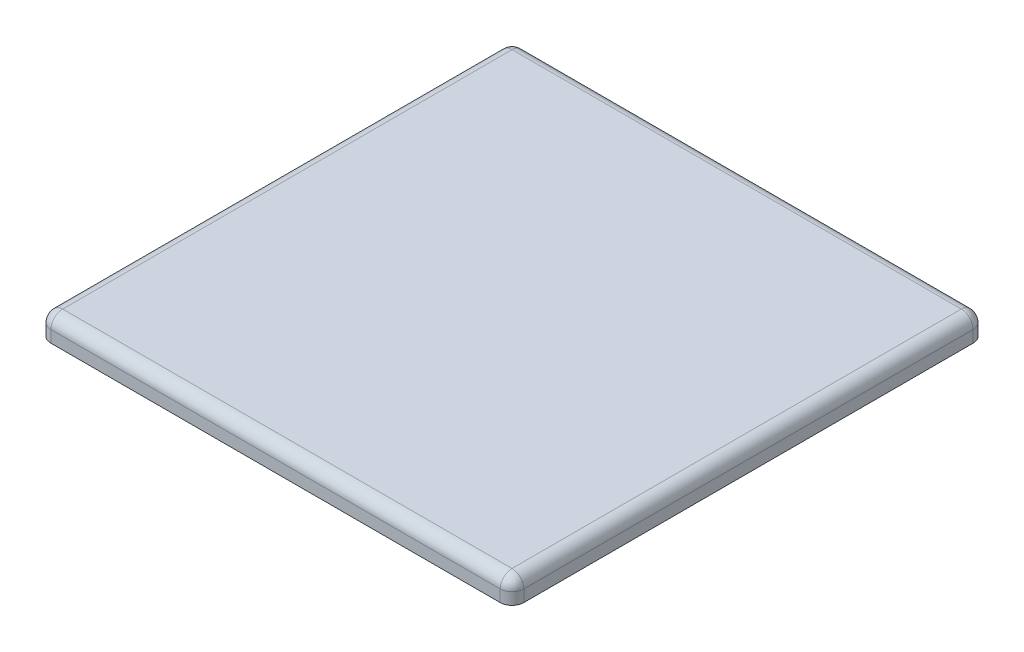
ISO-10303-21;
HEADER;
FILE_DESCRIPTION(('STEP AP214'),'2;1');
FILE_NAME('part.step','',(''),(''),'','','');
FILE_SCHEMA(('AUTOMOTIVE_DESIGN { 1 0 10303 214 1 1 1 1 }'));
ENDSEC;
DATA;
#1=APPLICATION_CONTEXT('core data for automotive mechanical design processes');
#2=APPLICATION_PROTOCOL_DEFINITION('international standard','automotive_design',2000,#1);
#3=PRODUCT_CONTEXT('',#1,'mechanical');
#4=PRODUCT('Part','Part','',(#3));
#5=PRODUCT_RELATED_PRODUCT_CATEGORY('part','',(#4));
#6=PRODUCT_DEFINITION_FORMATION('','',#4);
#7=PRODUCT_DEFINITION_CONTEXT('part definition',#1,'design');
#8=PRODUCT_DEFINITION('design','',#6,#7);
#9=PRODUCT_DEFINITION_SHAPE('','',#8);
#10=(LENGTH_UNIT() NAMED_UNIT(*) SI_UNIT(.MILLI.,.METRE.));
#11=(NAMED_UNIT(*) PLANE_ANGLE_UNIT() SI_UNIT($,.RADIAN.));
#12=(NAMED_UNIT(*) SI_UNIT($,.STERADIAN.) SOLID_ANGLE_UNIT());
#13=UNCERTAINTY_MEASURE_WITH_UNIT(LENGTH_MEASURE(1.E-05),#10,'distance_accuracy_value','');
#14=(GEOMETRIC_REPRESENTATION_CONTEXT(3) GLOBAL_UNCERTAINTY_ASSIGNED_CONTEXT((#13)) GLOBAL_UNIT_ASSIGNED_CONTEXT((#10,
#11,#12)) REPRESENTATION_CONTEXT('',''));
#15=CARTESIAN_POINT('',(0.,0.,0.));
#16=DIRECTION('',(0.,0.,1.));
#17=DIRECTION('',(1.,0.,0.));
#18=AXIS2_PLACEMENT_3D('',#15,#16,#17);
#19=CARTESIAN_POINT('',(254.,25.4,-254.));
#20=DIRECTION('',(-1.,0.,0.));
#21=DIRECTION('',(0.,0.,1.));
#22=AXIS2_PLACEMENT_3D('',#19,#20,#21);
#23=PLANE('',#22);
#24=DIRECTION('',(0.,0.,-1.));
#25=VECTOR('',#24,1.);
#26=CARTESIAN_POINT('',(254.,0.,-254.));
#27=LINE('',#26,#25);
#28=CARTESIAN_POINT('',(254.,0.,241.3));
#29=VERTEX_POINT('',#28);
#30=CARTESIAN_POINT('',(254.,0.,-241.3));
#31=VERTEX_POINT('',#30);
#32=EDGE_CURVE('E166',#29,#31,#27,.T.);
#33=ORIENTED_EDGE('',*,*,#32,.T.);
#34=DIRECTION('',(0.,-1.,0.));
#35=VECTOR('',#34,1.);
#36=CARTESIAN_POINT('',(254.,25.4,-241.3));
#37=LINE('',#36,#35);
#38=CARTESIAN_POINT('',(254.,12.7,-241.3));
#39=VERTEX_POINT('',#38);
#40=EDGE_CURVE('E156',#31,#39,#37,.F.);
#41=ORIENTED_EDGE('',*,*,#40,.T.);
#42=DIRECTION('',(0.,0.,-1.));
#43=VECTOR('',#42,1.);
#44=CARTESIAN_POINT('',(254.,12.7,254.));
#45=LINE('',#44,#43);
#46=CARTESIAN_POINT('',(254.,12.7,241.3));
#47=VERTEX_POINT('',#46);
#48=EDGE_CURVE('E202',#39,#47,#45,.F.);
#49=ORIENTED_EDGE('',*,*,#48,.T.);
#50=DIRECTION('',(0.,-1.,0.));
#51=VECTOR('',#50,1.);
#52=CARTESIAN_POINT('',(254.,25.4,241.3));
#53=LINE('',#52,#51);
#54=EDGE_CURVE('E148',#47,#29,#53,.T.);
#55=ORIENTED_EDGE('',*,*,#54,.T.);
#56=EDGE_LOOP('',(#33,#41,#49,#55));
#57=FACE_BOUND('',#56,.T.);
#58=ADVANCED_FACE('F38',(#57),#23,.F.);
#59=CARTESIAN_POINT('',(-254.,25.4,-254.));
#60=DIRECTION('',(0.,0.,1.));
#61=DIRECTION('',(1.,0.,0.));
#62=AXIS2_PLACEMENT_3D('',#59,#60,#61);
#63=PLANE('',#62);
#64=DIRECTION('',(-1.,0.,0.));
#65=VECTOR('',#64,1.);
#66=CARTESIAN_POINT('',(-254.,0.,-254.));
#67=LINE('',#66,#65);
#68=CARTESIAN_POINT('',(241.3,0.,-254.));
#69=VERTEX_POINT('',#68);
#70=CARTESIAN_POINT('',(-241.3,0.,-254.));
#71=VERTEX_POINT('',#70);
#72=EDGE_CURVE('E218',#69,#71,#67,.T.);
#73=ORIENTED_EDGE('',*,*,#72,.T.);
#74=DIRECTION('',(0.,-1.,0.));
#75=VECTOR('',#74,1.);
#76=CARTESIAN_POINT('',(-241.3,25.4,-254.));
#77=LINE('',#76,#75);
#78=CARTESIAN_POINT('',(-241.3,12.7,-254.));
#79=VERTEX_POINT('',#78);
#80=EDGE_CURVE('E186',#71,#79,#77,.F.);
#81=ORIENTED_EDGE('',*,*,#80,.T.);
#82=DIRECTION('',(-1.,0.,0.));
#83=VECTOR('',#82,1.);
#84=CARTESIAN_POINT('',(254.,12.7,-254.));
#85=LINE('',#84,#83);
#86=CARTESIAN_POINT('',(241.3,12.7,-254.));
#87=VERTEX_POINT('',#86);
#88=EDGE_CURVE('E208',#79,#87,#85,.F.);
#89=ORIENTED_EDGE('',*,*,#88,.T.);
#90=DIRECTION('',(0.,-1.,0.));
#91=VECTOR('',#90,1.);
#92=CARTESIAN_POINT('',(241.3,25.4,-254.));
#93=LINE('',#92,#91);
#94=EDGE_CURVE('E188',#87,#69,#93,.T.);
#95=ORIENTED_EDGE('',*,*,#94,.T.);
#96=EDGE_LOOP('',(#73,#81,#89,#95));
#97=FACE_BOUND('',#96,.T.);
#98=ADVANCED_FACE('F239',(#97),#63,.F.);
#99=CARTESIAN_POINT('',(-254.,25.4,-254.));
#100=DIRECTION('',(1.,0.,0.));
#101=DIRECTION('',(0.,0.,-1.));
#102=AXIS2_PLACEMENT_3D('',#99,#100,#101);
#103=PLANE('',#102);
#104=DIRECTION('',(0.,0.,1.));
#105=VECTOR('',#104,1.);
#106=CARTESIAN_POINT('',(-254.,12.7,-254.));
#107=LINE('',#106,#105);
#108=CARTESIAN_POINT('',(-254.,12.7,241.3));
#109=VERTEX_POINT('',#108);
#110=CARTESIAN_POINT('',(-254.,12.7,-241.3));
#111=VERTEX_POINT('',#110);
#112=EDGE_CURVE('E205',#109,#111,#107,.F.);
#113=ORIENTED_EDGE('',*,*,#112,.T.);
#114=DIRECTION('',(0.,-1.,0.));
#115=VECTOR('',#114,1.);
#116=CARTESIAN_POINT('',(-254.,25.4,-241.3));
#117=LINE('',#116,#115);
#118=CARTESIAN_POINT('',(-254.,0.,-241.3));
#119=VERTEX_POINT('',#118);
#120=EDGE_CURVE('E198',#111,#119,#117,.T.);
#121=ORIENTED_EDGE('',*,*,#120,.T.);
#122=DIRECTION('',(0.,0.,1.));
#123=VECTOR('',#122,1.);
#124=CARTESIAN_POINT('',(-254.,0.,-254.));
#125=LINE('',#124,#123);
#126=CARTESIAN_POINT('',(-254.,0.,241.3));
#127=VERTEX_POINT('',#126);
#128=EDGE_CURVE('E215',#119,#127,#125,.T.);
#129=ORIENTED_EDGE('',*,*,#128,.T.);
#130=DIRECTION('',(0.,-1.,0.));
#131=VECTOR('',#130,1.);
#132=CARTESIAN_POINT('',(-254.,25.4,241.3));
#133=LINE('',#132,#131);
#134=EDGE_CURVE('E175',#127,#109,#133,.F.);
#135=ORIENTED_EDGE('',*,*,#134,.T.);
#136=EDGE_LOOP('',(#113,#121,#129,#135));
#137=FACE_BOUND('',#136,.T.);
#138=ADVANCED_FACE('F251',(#137),#103,.F.);
#139=CARTESIAN_POINT('',(-254.,25.4,254.));
#140=DIRECTION('',(0.,0.,-1.));
#141=DIRECTION('',(-1.,0.,0.));
#142=AXIS2_PLACEMENT_3D('',#139,#140,#141);
#143=PLANE('',#142);
#144=DIRECTION('',(1.,0.,0.));
#145=VECTOR('',#144,1.);
#146=CARTESIAN_POINT('',(-254.,0.,254.));
#147=LINE('',#146,#145);
#148=CARTESIAN_POINT('',(-241.3,0.,254.));
#149=VERTEX_POINT('',#148);
#150=CARTESIAN_POINT('',(241.3,0.,254.));
#151=VERTEX_POINT('',#150);
#152=EDGE_CURVE('E141',#149,#151,#147,.T.);
#153=ORIENTED_EDGE('',*,*,#152,.T.);
#154=DIRECTION('',(0.,-1.,0.));
#155=VECTOR('',#154,1.);
#156=CARTESIAN_POINT('',(241.3,25.4,254.));
#157=LINE('',#156,#155);
#158=CARTESIAN_POINT('',(241.3,12.7,254.));
#159=VERTEX_POINT('',#158);
#160=EDGE_CURVE('E61',#151,#159,#157,.F.);
#161=ORIENTED_EDGE('',*,*,#160,.T.);
#162=DIRECTION('',(1.,0.,0.));
#163=VECTOR('',#162,1.);
#164=CARTESIAN_POINT('',(-254.,12.7,254.));
#165=LINE('',#164,#163);
#166=CARTESIAN_POINT('',(-241.3,12.7,254.));
#167=VERTEX_POINT('',#166);
#168=EDGE_CURVE('E118',#159,#167,#165,.F.);
#169=ORIENTED_EDGE('',*,*,#168,.T.);
#170=DIRECTION('',(0.,-1.,0.));
#171=VECTOR('',#170,1.);
#172=CARTESIAN_POINT('',(-241.3,25.4,254.));
#173=LINE('',#172,#171);
#174=EDGE_CURVE('E158',#167,#149,#173,.T.);
#175=ORIENTED_EDGE('',*,*,#174,.T.);
#176=EDGE_LOOP('',(#153,#161,#169,#175));
#177=FACE_BOUND('',#176,.T.);
#178=ADVANCED_FACE('F255',(#177),#143,.F.);
#179=CARTESIAN_POINT('',(0.,25.4,0.));
#180=DIRECTION('',(0.,1.,0.));
#181=DIRECTION('',(0.,0.,1.));
#182=AXIS2_PLACEMENT_3D('',#179,#180,#181);
#183=PLANE('',#182);
#184=DIRECTION('',(0.,0.,-1.));
#185=VECTOR('',#184,1.);
#186=CARTESIAN_POINT('',(241.3,25.4,-254.));
#187=LINE('',#186,#185);
#188=CARTESIAN_POINT('',(241.3,25.4,241.3));
#189=VERTEX_POINT('',#188);
#190=CARTESIAN_POINT('',(241.3,25.4,-241.3));
#191=VERTEX_POINT('',#190);
#192=EDGE_CURVE('E129',#189,#191,#187,.T.);
#193=ORIENTED_EDGE('',*,*,#192,.T.);
#194=DIRECTION('',(-1.,0.,0.));
#195=VECTOR('',#194,1.);
#196=CARTESIAN_POINT('',(-254.,25.4,-241.3));
#197=LINE('',#196,#195);
#198=CARTESIAN_POINT('',(-241.3,25.4,-241.3));
#199=VERTEX_POINT('',#198);
#200=EDGE_CURVE('E211',#191,#199,#197,.T.);
#201=ORIENTED_EDGE('',*,*,#200,.T.);
#202=DIRECTION('',(0.,0.,1.));
#203=VECTOR('',#202,1.);
#204=CARTESIAN_POINT('',(-241.3,25.4,254.));
#205=LINE('',#204,#203);
#206=CARTESIAN_POINT('',(-241.3,25.4,241.3));
#207=VERTEX_POINT('',#206);
#208=EDGE_CURVE('E132',#199,#207,#205,.T.);
#209=ORIENTED_EDGE('',*,*,#208,.T.);
#210=DIRECTION('',(1.,0.,0.));
#211=VECTOR('',#210,1.);
#212=CARTESIAN_POINT('',(254.,25.4,241.3));
#213=LINE('',#212,#211);
#214=EDGE_CURVE('E117',#207,#189,#213,.T.);
#215=ORIENTED_EDGE('',*,*,#214,.T.);
#216=EDGE_LOOP('',(#193,#201,#209,#215));
#217=FACE_BOUND('',#216,.T.);
#218=ADVANCED_FACE('F127',(#217),#183,.T.);
#219=CARTESIAN_POINT('',(0.,0.,0.));
#220=DIRECTION('',(0.,1.,0.));
#221=DIRECTION('',(0.,0.,1.));
#222=AXIS2_PLACEMENT_3D('',#219,#220,#221);
#223=PLANE('',#222);
#224=ORIENTED_EDGE('',*,*,#128,.F.);
#225=CARTESIAN_POINT('',(-241.3,0.,-241.3));
#226=DIRECTION('',(0.,1.,0.));
#227=DIRECTION('',(0.,0.,1.));
#228=AXIS2_PLACEMENT_3D('',#225,#226,#227);
#229=CIRCLE('',#228,12.7);
#230=EDGE_CURVE('E190',#119,#71,#229,.F.);
#231=ORIENTED_EDGE('',*,*,#230,.T.);
#232=ORIENTED_EDGE('',*,*,#72,.F.);
#233=CARTESIAN_POINT('',(241.3,0.,-241.3));
#234=DIRECTION('',(0.,1.,0.));
#235=DIRECTION('',(0.,0.,1.));
#236=AXIS2_PLACEMENT_3D('',#233,#234,#235);
#237=CIRCLE('',#236,12.7);
#238=EDGE_CURVE('E192',#69,#31,#237,.F.);
#239=ORIENTED_EDGE('',*,*,#238,.T.);
#240=ORIENTED_EDGE('',*,*,#32,.F.);
#241=CARTESIAN_POINT('',(241.3,0.,241.3));
#242=DIRECTION('',(0.,1.,0.));
#243=DIRECTION('',(0.,0.,1.));
#244=AXIS2_PLACEMENT_3D('',#241,#242,#243);
#245=CIRCLE('',#244,12.7);
#246=EDGE_CURVE('E194',#29,#151,#245,.F.);
#247=ORIENTED_EDGE('',*,*,#246,.T.);
#248=ORIENTED_EDGE('',*,*,#152,.F.);
#249=CARTESIAN_POINT('',(-241.3,0.,241.3));
#250=DIRECTION('',(0.,1.,0.));
#251=DIRECTION('',(0.,0.,1.));
#252=AXIS2_PLACEMENT_3D('',#249,#250,#251);
#253=CIRCLE('',#252,12.7);
#254=EDGE_CURVE('E196',#149,#127,#253,.F.);
#255=ORIENTED_EDGE('',*,*,#254,.T.);
#256=EDGE_LOOP('',(#224,#231,#232,#239,#240,#247,#248,#255));
#257=FACE_BOUND('',#256,.T.);
#258=ADVANCED_FACE('F253',(#257),#223,.F.);
#259=CARTESIAN_POINT('',(0.,12.7,241.3));
#260=DIRECTION('',(-1.,0.,0.));
#261=DIRECTION('',(0.,0.,1.));
#262=AXIS2_PLACEMENT_3D('',#259,#260,#261);
#263=CYLINDRICAL_SURFACE('',#262,12.7);
#264=ORIENTED_EDGE('',*,*,#168,.F.);
#265=CARTESIAN_POINT('',(241.3,12.7,241.3));
#266=DIRECTION('',(-1.,0.,0.));
#267=DIRECTION('',(0.,0.,1.));
#268=AXIS2_PLACEMENT_3D('',#265,#266,#267);
#269=CIRCLE('',#268,12.7);
#270=EDGE_CURVE('E11',#159,#189,#269,.T.);
#271=ORIENTED_EDGE('',*,*,#270,.T.);
#272=ORIENTED_EDGE('',*,*,#214,.F.);
#273=CARTESIAN_POINT('',(-241.3,12.7,241.3));
#274=DIRECTION('',(-1.,0.,0.));
#275=DIRECTION('',(0.,0.,1.));
#276=AXIS2_PLACEMENT_3D('',#273,#274,#275);
#277=CIRCLE('',#276,12.7);
#278=EDGE_CURVE('E47',#207,#167,#277,.F.);
#279=ORIENTED_EDGE('',*,*,#278,.T.);
#280=EDGE_LOOP('',(#264,#271,#272,#279));
#281=FACE_BOUND('',#280,.T.);
#282=ADVANCED_FACE('F116',(#281),#263,.T.);
#283=CARTESIAN_POINT('',(241.3,12.7,0.));
#284=DIRECTION('',(0.,0.,1.));
#285=DIRECTION('',(1.,0.,0.));
#286=AXIS2_PLACEMENT_3D('',#283,#284,#285);
#287=CYLINDRICAL_SURFACE('',#286,12.7);
#288=ORIENTED_EDGE('',*,*,#48,.F.);
#289=CARTESIAN_POINT('',(241.3,12.7,-241.3));
#290=DIRECTION('',(0.,0.,1.));
#291=DIRECTION('',(1.,0.,0.));
#292=AXIS2_PLACEMENT_3D('',#289,#290,#291);
#293=CIRCLE('',#292,12.7);
#294=EDGE_CURVE('E140',#39,#191,#293,.T.);
#295=ORIENTED_EDGE('',*,*,#294,.T.);
#296=ORIENTED_EDGE('',*,*,#192,.F.);
#297=CARTESIAN_POINT('',(241.3,12.7,241.3));
#298=DIRECTION('',(0.,0.,1.));
#299=DIRECTION('',(1.,0.,0.));
#300=AXIS2_PLACEMENT_3D('',#297,#298,#299);
#301=CIRCLE('',#300,12.7);
#302=EDGE_CURVE('E137',#189,#47,#301,.F.);
#303=ORIENTED_EDGE('',*,*,#302,.T.);
#304=EDGE_LOOP('',(#288,#295,#296,#303));
#305=FACE_BOUND('',#304,.T.);
#306=ADVANCED_FACE('F136',(#305),#287,.T.);
#307=CARTESIAN_POINT('',(-241.3,12.7,0.));
#308=DIRECTION('',(0.,0.,-1.));
#309=DIRECTION('',(-1.,0.,0.));
#310=AXIS2_PLACEMENT_3D('',#307,#308,#309);
#311=CYLINDRICAL_SURFACE('',#310,12.7);
#312=ORIENTED_EDGE('',*,*,#208,.F.);
#313=CARTESIAN_POINT('',(-241.3,12.7,-241.3));
#314=DIRECTION('',(0.,0.,-1.));
#315=DIRECTION('',(-1.,0.,0.));
#316=AXIS2_PLACEMENT_3D('',#313,#314,#315);
#317=CIRCLE('',#316,12.7);
#318=EDGE_CURVE('E146',#199,#111,#317,.F.);
#319=ORIENTED_EDGE('',*,*,#318,.T.);
#320=ORIENTED_EDGE('',*,*,#112,.F.);
#321=CARTESIAN_POINT('',(-241.3,12.7,241.3));
#322=DIRECTION('',(0.,0.,-1.));
#323=DIRECTION('',(-1.,0.,0.));
#324=AXIS2_PLACEMENT_3D('',#321,#322,#323);
#325=CIRCLE('',#324,12.7);
#326=EDGE_CURVE('E150',#109,#207,#325,.T.);
#327=ORIENTED_EDGE('',*,*,#326,.T.);
#328=EDGE_LOOP('',(#312,#319,#320,#327));
#329=FACE_BOUND('',#328,.T.);
#330=ADVANCED_FACE('F249',(#329),#311,.T.);
#331=CARTESIAN_POINT('',(0.,12.7,-241.3));
#332=DIRECTION('',(1.,0.,0.));
#333=DIRECTION('',(0.,0.,-1.));
#334=AXIS2_PLACEMENT_3D('',#331,#332,#333);
#335=CYLINDRICAL_SURFACE('',#334,12.7);
#336=ORIENTED_EDGE('',*,*,#88,.F.);
#337=CARTESIAN_POINT('',(-241.3,12.7,-241.3));
#338=DIRECTION('',(1.,0.,0.));
#339=DIRECTION('',(0.,0.,-1.));
#340=AXIS2_PLACEMENT_3D('',#337,#338,#339);
#341=CIRCLE('',#340,12.7);
#342=EDGE_CURVE('E180',#79,#199,#341,.T.);
#343=ORIENTED_EDGE('',*,*,#342,.T.);
#344=ORIENTED_EDGE('',*,*,#200,.F.);
#345=CARTESIAN_POINT('',(241.3,12.7,-241.3));
#346=DIRECTION('',(1.,0.,0.));
#347=DIRECTION('',(0.,0.,-1.));
#348=AXIS2_PLACEMENT_3D('',#345,#346,#347);
#349=CIRCLE('',#348,12.7);
#350=EDGE_CURVE('E181',#191,#87,#349,.F.);
#351=ORIENTED_EDGE('',*,*,#350,.T.);
#352=EDGE_LOOP('',(#336,#343,#344,#351));
#353=FACE_BOUND('',#352,.T.);
#354=ADVANCED_FACE('F236',(#353),#335,.T.);
#355=CARTESIAN_POINT('',(-241.3,12.7,-241.3));
#356=DIRECTION('',(0.,0.,1.));
#357=DIRECTION('',(1.,0.,0.));
#358=AXIS2_PLACEMENT_3D('',#355,#356,#357);
#359=SPHERICAL_SURFACE('',#358,12.7);
#360=ORIENTED_EDGE('',*,*,#318,.F.);
#361=ORIENTED_EDGE('',*,*,#342,.F.);
#362=CARTESIAN_POINT('',(-241.3,12.7,-241.3));
#363=DIRECTION('',(0.,-1.,0.));
#364=DIRECTION('',(0.,0.,-1.));
#365=AXIS2_PLACEMENT_3D('',#362,#363,#364);
#366=CIRCLE('',#365,12.7);
#367=EDGE_CURVE('E163',#111,#79,#366,.T.);
#368=ORIENTED_EDGE('',*,*,#367,.F.);
#369=EDGE_LOOP('',(#360,#361,#368));
#370=FACE_BOUND('',#369,.T.);
#371=ADVANCED_FACE('F248',(#370),#359,.T.);
#372=CARTESIAN_POINT('',(-241.3,25.4,-241.3));
#373=DIRECTION('',(0.,-1.,0.));
#374=DIRECTION('',(0.,0.,-1.));
#375=AXIS2_PLACEMENT_3D('',#372,#373,#374);
#376=CYLINDRICAL_SURFACE('',#375,12.7);
#377=ORIENTED_EDGE('',*,*,#367,.T.);
#378=ORIENTED_EDGE('',*,*,#80,.F.);
#379=ORIENTED_EDGE('',*,*,#230,.F.);
#380=ORIENTED_EDGE('',*,*,#120,.F.);
#381=EDGE_LOOP('',(#377,#378,#379,#380));
#382=FACE_BOUND('',#381,.T.);
#383=ADVANCED_FACE('F243',(#382),#376,.T.);
#384=CARTESIAN_POINT('',(241.3,25.4,-241.3));
#385=DIRECTION('',(0.,-1.,0.));
#386=DIRECTION('',(0.,0.,-1.));
#387=AXIS2_PLACEMENT_3D('',#384,#385,#386);
#388=CYLINDRICAL_SURFACE('',#387,12.7);
#389=ORIENTED_EDGE('',*,*,#238,.F.);
#390=ORIENTED_EDGE('',*,*,#94,.F.);
#391=CARTESIAN_POINT('',(241.3,12.7,-241.3));
#392=DIRECTION('',(0.,1.,0.));
#393=DIRECTION('',(0.,0.,1.));
#394=AXIS2_PLACEMENT_3D('',#391,#392,#393);
#395=CIRCLE('',#394,12.7);
#396=EDGE_CURVE('E167',#39,#87,#395,.T.);
#397=ORIENTED_EDGE('',*,*,#396,.F.);
#398=ORIENTED_EDGE('',*,*,#40,.F.);
#399=EDGE_LOOP('',(#389,#390,#397,#398));
#400=FACE_BOUND('',#399,.T.);
#401=ADVANCED_FACE('F229',(#400),#388,.T.);
#402=CARTESIAN_POINT('',(241.3,12.7,-241.3));
#403=DIRECTION('',(0.,0.,1.));
#404=DIRECTION('',(1.,0.,0.));
#405=AXIS2_PLACEMENT_3D('',#402,#403,#404);
#406=SPHERICAL_SURFACE('',#405,12.7);
#407=ORIENTED_EDGE('',*,*,#350,.F.);
#408=ORIENTED_EDGE('',*,*,#294,.F.);
#409=ORIENTED_EDGE('',*,*,#396,.T.);
#410=EDGE_LOOP('',(#407,#408,#409));
#411=FACE_BOUND('',#410,.T.);
#412=ADVANCED_FACE('F233',(#411),#406,.T.);
#413=CARTESIAN_POINT('',(241.3,12.7,241.3));
#414=DIRECTION('',(0.,0.,1.));
#415=DIRECTION('',(1.,0.,0.));
#416=AXIS2_PLACEMENT_3D('',#413,#414,#415);
#417=SPHERICAL_SURFACE('',#416,12.7);
#418=ORIENTED_EDGE('',*,*,#302,.F.);
#419=ORIENTED_EDGE('',*,*,#270,.F.);
#420=CARTESIAN_POINT('',(241.3,12.7,241.3));
#421=DIRECTION('',(0.,-1.,0.));
#422=DIRECTION('',(0.,0.,-1.));
#423=AXIS2_PLACEMENT_3D('',#420,#421,#422);
#424=CIRCLE('',#423,12.7);
#425=EDGE_CURVE('E144',#47,#159,#424,.T.);
#426=ORIENTED_EDGE('',*,*,#425,.F.);
#427=EDGE_LOOP('',(#418,#419,#426));
#428=FACE_BOUND('',#427,.T.);
#429=ADVANCED_FACE('F143',(#428),#417,.T.);
#430=CARTESIAN_POINT('',(241.3,25.4,241.3));
#431=DIRECTION('',(0.,-1.,0.));
#432=DIRECTION('',(0.,0.,-1.));
#433=AXIS2_PLACEMENT_3D('',#430,#431,#432);
#434=CYLINDRICAL_SURFACE('',#433,12.7);
#435=ORIENTED_EDGE('',*,*,#425,.T.);
#436=ORIENTED_EDGE('',*,*,#160,.F.);
#437=ORIENTED_EDGE('',*,*,#246,.F.);
#438=ORIENTED_EDGE('',*,*,#54,.F.);
#439=EDGE_LOOP('',(#435,#436,#437,#438));
#440=FACE_BOUND('',#439,.T.);
#441=ADVANCED_FACE('F256',(#440),#434,.T.);
#442=CARTESIAN_POINT('',(-241.3,12.7,241.3));
#443=DIRECTION('',(0.,0.,1.));
#444=DIRECTION('',(1.,0.,0.));
#445=AXIS2_PLACEMENT_3D('',#442,#443,#444);
#446=SPHERICAL_SURFACE('',#445,12.7);
#447=ORIENTED_EDGE('',*,*,#278,.F.);
#448=ORIENTED_EDGE('',*,*,#326,.F.);
#449=CARTESIAN_POINT('',(-241.3,12.7,241.3));
#450=DIRECTION('',(0.,-1.,0.));
#451=DIRECTION('',(0.,0.,-1.));
#452=AXIS2_PLACEMENT_3D('',#449,#450,#451);
#453=CIRCLE('',#452,12.7);
#454=EDGE_CURVE('E42',#167,#109,#453,.T.);
#455=ORIENTED_EDGE('',*,*,#454,.F.);
#456=EDGE_LOOP('',(#447,#448,#455));
#457=FACE_BOUND('',#456,.T.);
#458=ADVANCED_FACE('F40',(#457),#446,.T.);
#459=CARTESIAN_POINT('',(-241.3,25.4,241.3));
#460=DIRECTION('',(0.,-1.,0.));
#461=DIRECTION('',(0.,0.,-1.));
#462=AXIS2_PLACEMENT_3D('',#459,#460,#461);
#463=CYLINDRICAL_SURFACE('',#462,12.7);
#464=ORIENTED_EDGE('',*,*,#454,.T.);
#465=ORIENTED_EDGE('',*,*,#134,.F.);
#466=ORIENTED_EDGE('',*,*,#254,.F.);
#467=ORIENTED_EDGE('',*,*,#174,.F.);
#468=EDGE_LOOP('',(#464,#465,#466,#467));
#469=FACE_BOUND('',#468,.T.);
#470=ADVANCED_FACE('F174',(#469),#463,.T.);
#471=CLOSED_SHELL('',(#58,#98,#138,#178,#218,#258,#282,#306,#330,#354,#371,#383,#401,#412,#429,
#441,#458,#470));
#472=MANIFOLD_SOLID_BREP('B2',#471);
#473=ADVANCED_BREP_SHAPE_REPRESENTATION('',(#18,#472),#14);
#474=SHAPE_DEFINITION_REPRESENTATION(#9,#473);
ENDSEC;
END-ISO-10303-21;
